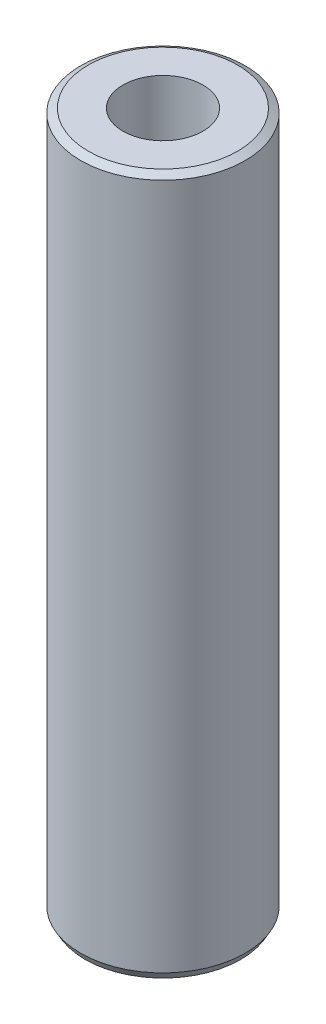
ISO-10303-21;
HEADER;
FILE_DESCRIPTION(('STEP AP214'),'2;1');
FILE_NAME('part.step','',(''),(''),'','','');
FILE_SCHEMA(('AUTOMOTIVE_DESIGN { 1 0 10303 214 1 1 1 1 }'));
ENDSEC;
DATA;
#1=APPLICATION_CONTEXT('core data for automotive mechanical design processes');
#2=APPLICATION_PROTOCOL_DEFINITION('international standard','automotive_design',2000,#1);
#3=PRODUCT_CONTEXT('',#1,'mechanical');
#4=PRODUCT('Part','Part','',(#3));
#5=PRODUCT_RELATED_PRODUCT_CATEGORY('part','',(#4));
#6=PRODUCT_DEFINITION_FORMATION('','',#4);
#7=PRODUCT_DEFINITION_CONTEXT('part definition',#1,'design');
#8=PRODUCT_DEFINITION('design','',#6,#7);
#9=PRODUCT_DEFINITION_SHAPE('','',#8);
#10=(LENGTH_UNIT() NAMED_UNIT(*) SI_UNIT(.MILLI.,.METRE.));
#11=(NAMED_UNIT(*) PLANE_ANGLE_UNIT() SI_UNIT($,.RADIAN.));
#12=(NAMED_UNIT(*) SI_UNIT($,.STERADIAN.) SOLID_ANGLE_UNIT());
#13=UNCERTAINTY_MEASURE_WITH_UNIT(LENGTH_MEASURE(1.E-05),#10,'distance_accuracy_value','');
#14=(GEOMETRIC_REPRESENTATION_CONTEXT(3) GLOBAL_UNCERTAINTY_ASSIGNED_CONTEXT((#13)) GLOBAL_UNIT_ASSIGNED_CONTEXT((#10,
#11,#12)) REPRESENTATION_CONTEXT('',''));
#15=CARTESIAN_POINT('',(0.,0.,0.));
#16=DIRECTION('',(0.,0.,1.));
#17=DIRECTION('',(1.,0.,0.));
#18=AXIS2_PLACEMENT_3D('',#15,#16,#17);
#19=CARTESIAN_POINT('',(0.,84.9295213359798,0.));
#20=DIRECTION('',(0.,-1.,0.));
#21=DIRECTION('',(0.,0.,-1.));
#22=AXIS2_PLACEMENT_3D('',#19,#20,#21);
#23=CYLINDRICAL_SURFACE('',#22,10.);
#24=CARTESIAN_POINT('',(0.,84.3989924388494,0.));
#25=DIRECTION('',(0.,1.,0.));
#26=DIRECTION('',(0.,0.,1.));
#27=AXIS2_PLACEMENT_3D('',#24,#25,#26);
#28=CIRCLE('',#27,10.);
#29=CARTESIAN_POINT('',(0.,84.3989924388494,10.));
#30=VERTEX_POINT('',#29);
#31=EDGE_CURVE('E50',#30,#30,#28,.F.);
#32=ORIENTED_EDGE('',*,*,#31,.T.);
#33=EDGE_LOOP('',(#32));
#34=FACE_BOUND('',#33,.T.);
#35=CARTESIAN_POINT('',(0.,0.918903004713367,0.));
#36=DIRECTION('',(0.,1.,0.));
#37=DIRECTION('',(0.,0.,1.));
#38=AXIS2_PLACEMENT_3D('',#35,#36,#37);
#39=CIRCLE('',#38,10.);
#40=CARTESIAN_POINT('',(0.,0.918903004713367,10.));
#41=VERTEX_POINT('',#40);
#42=EDGE_CURVE('E51',#41,#41,#39,.T.);
#43=ORIENTED_EDGE('',*,*,#42,.T.);
#44=EDGE_LOOP('',(#43));
#45=FACE_BOUND('',#44,.T.);
#46=ADVANCED_FACE('F39',(#34,#45),#23,.T.);
#47=CARTESIAN_POINT('',(0.,84.9295213359798,0.));
#48=DIRECTION('',(0.,1.,0.));
#49=DIRECTION('',(0.,0.,1.));
#50=AXIS2_PLACEMENT_3D('',#47,#48,#49);
#51=PLANE('',#50);
#52=CARTESIAN_POINT('',(0.,84.9295213359798,0.));
#53=DIRECTION('',(0.,1.,0.));
#54=DIRECTION('',(0.,0.,1.));
#55=AXIS2_PLACEMENT_3D('',#52,#53,#54);
#56=CIRCLE('',#55,9.0810969952866);
#57=CARTESIAN_POINT('',(0.,84.9295213359798,9.0810969952866));
#58=VERTEX_POINT('',#57);
#59=EDGE_CURVE('E54',#58,#58,#56,.T.);
#60=ORIENTED_EDGE('',*,*,#59,.T.);
#61=EDGE_LOOP('',(#60));
#62=FACE_BOUND('',#61,.T.);
#63=CARTESIAN_POINT('',(0.,84.9295213359798,0.));
#64=DIRECTION('',(0.,1.,0.));
#65=DIRECTION('',(0.,0.,1.));
#66=AXIS2_PLACEMENT_3D('',#63,#64,#65);
#67=CIRCLE('',#66,4.86979811108626);
#68=CARTESIAN_POINT('',(0.,84.9295213359798,4.86979811108626));
#69=VERTEX_POINT('',#68);
#70=EDGE_CURVE('E58',#69,#69,#67,.T.);
#71=ORIENTED_EDGE('',*,*,#70,.F.);
#72=EDGE_LOOP('',(#71));
#73=FACE_BOUND('',#72,.T.);
#74=ADVANCED_FACE('F69',(#62,#73),#51,.T.);
#75=CARTESIAN_POINT('',(0.,0.,0.));
#76=DIRECTION('',(0.,1.,0.));
#77=DIRECTION('',(0.,0.,1.));
#78=AXIS2_PLACEMENT_3D('',#75,#76,#77);
#79=PLANE('',#78);
#80=CARTESIAN_POINT('',(0.,0.,0.));
#81=DIRECTION('',(0.,1.,0.));
#82=DIRECTION('',(0.,0.,1.));
#83=AXIS2_PLACEMENT_3D('',#80,#81,#82);
#84=CIRCLE('',#83,9.46947110286958);
#85=CARTESIAN_POINT('',(0.,0.,9.46947110286958));
#86=VERTEX_POINT('',#85);
#87=EDGE_CURVE('E10',#86,#86,#84,.F.);
#88=ORIENTED_EDGE('',*,*,#87,.T.);
#89=EDGE_LOOP('',(#88));
#90=FACE_BOUND('',#89,.T.);
#91=CARTESIAN_POINT('',(0.,0.,0.));
#92=DIRECTION('',(0.,1.,0.));
#93=DIRECTION('',(0.,0.,1.));
#94=AXIS2_PLACEMENT_3D('',#91,#92,#93);
#95=CIRCLE('',#94,4.86979811108626);
#96=CARTESIAN_POINT('',(0.,0.,4.86979811108626));
#97=VERTEX_POINT('',#96);
#98=EDGE_CURVE('E63',#97,#97,#95,.T.);
#99=ORIENTED_EDGE('',*,*,#98,.T.);
#100=EDGE_LOOP('',(#99));
#101=FACE_BOUND('',#100,.T.);
#102=ADVANCED_FACE('F75',(#90,#101),#79,.F.);
#103=CARTESIAN_POINT('',(0.,84.9295213359798,0.));
#104=DIRECTION('',(0.,-1.,0.));
#105=DIRECTION('',(0.,0.,-1.));
#106=AXIS2_PLACEMENT_3D('',#103,#104,#105);
#107=CYLINDRICAL_SURFACE('',#106,4.86979811108626);
#108=ORIENTED_EDGE('',*,*,#70,.T.);
#109=EDGE_LOOP('',(#108));
#110=FACE_BOUND('',#109,.T.);
#111=ORIENTED_EDGE('',*,*,#98,.F.);
#112=EDGE_LOOP('',(#111));
#113=FACE_BOUND('',#112,.T.);
#114=ADVANCED_FACE('F70',(#110,#113),#107,.F.);
#115=CARTESIAN_POINT('',(0.,84.9295213359798,0.));
#116=DIRECTION('',(0.,-1.,0.));
#117=DIRECTION('',(0.,0.,-1.));
#118=AXIS2_PLACEMENT_3D('',#115,#116,#117);
#119=CONICAL_SURFACE('',#118,9.0810969952866,1.04719755119659);
#120=ORIENTED_EDGE('',*,*,#31,.F.);
#121=EDGE_LOOP('',(#120));
#122=FACE_BOUND('',#121,.T.);
#123=ORIENTED_EDGE('',*,*,#59,.F.);
#124=EDGE_LOOP('',(#123));
#125=FACE_BOUND('',#124,.T.);
#126=ADVANCED_FACE('F81',(#122,#125),#119,.T.);
#127=CARTESIAN_POINT('',(0.,0.918903004713367,0.));
#128=DIRECTION('',(0.,1.,0.));
#129=DIRECTION('',(0.,0.,1.));
#130=AXIS2_PLACEMENT_3D('',#127,#128,#129);
#131=CONICAL_SURFACE('',#130,10.,0.523598775598299);
#132=CARTESIAN_POINT('',(0.,0.,9.46947110286958));
#133=CARTESIAN_POINT('',(0.,0.00957190629909782,9.47499744554802));
#134=CARTESIAN_POINT('',(0.,0.0191438125981953,9.48052378822647));
#135=CARTESIAN_POINT('',(0.,0.0382876251963902,9.49157647358335));
#136=CARTESIAN_POINT('',(0.,0.0478595314954877,9.49710281626179));
#137=CARTESIAN_POINT('',(0.,0.0670033440936828,9.50815550161867));
#138=CARTESIAN_POINT('',(0.,0.0765752503927804,9.51368184429712));
#139=CARTESIAN_POINT('',(0.,0.0957190629909757,9.524734529654));
#140=CARTESIAN_POINT('',(0.,0.105290969290073,9.53026087233244));
#141=CARTESIAN_POINT('',(0.,0.124434781888268,9.54131355768932));
#142=CARTESIAN_POINT('',(0.,0.134006688187366,9.54683990036777));
#143=CARTESIAN_POINT('',(0.,0.153150500785561,9.55789258572465));
#144=CARTESIAN_POINT('',(0.,0.162722407084659,9.56341892840309));
#145=CARTESIAN_POINT('',(0.,0.181866219682854,9.57447161375998));
#146=CARTESIAN_POINT('',(0.,0.191438125981952,9.57999795643842));
#147=CARTESIAN_POINT('',(0.,0.210581938580147,9.5910506417953));
#148=CARTESIAN_POINT('',(0.,0.220153844879244,9.59657698447374));
#149=CARTESIAN_POINT('',(0.,0.239297657477439,9.60762966983063));
#150=CARTESIAN_POINT('',(0.,0.248869563776537,9.61315601250907));
#151=CARTESIAN_POINT('',(0.,0.268013376374732,9.62420869786595));
#152=CARTESIAN_POINT('',(0.,0.27758528267383,9.62973504054439));
#153=CARTESIAN_POINT('',(0.,0.296729095272025,9.64078772590128));
#154=CARTESIAN_POINT('',(0.,0.306301001571122,9.64631406857972));
#155=CARTESIAN_POINT('',(0.,0.325444814169317,9.65736675393661));
#156=CARTESIAN_POINT('',(0.,0.335016720468415,9.66289309661505));
#157=CARTESIAN_POINT('',(0.,0.35416053306661,9.67394578197193));
#158=CARTESIAN_POINT('',(0.,0.363732439365708,9.67947212465037));
#159=CARTESIAN_POINT('',(0.,0.382876251963903,9.69052481000725));
#160=CARTESIAN_POINT('',(0.,0.392448158263,9.6960511526857));
#161=CARTESIAN_POINT('',(0.,0.411591970861195,9.70710383804258));
#162=CARTESIAN_POINT('',(0.,0.421163877160293,9.71263018072102));
#163=CARTESIAN_POINT('',(0.,0.440307689758488,9.72368286607791));
#164=CARTESIAN_POINT('',(0.,0.449879596057586,9.72920920875635));
#165=CARTESIAN_POINT('',(0.,0.469023408655781,9.74026189411323));
#166=CARTESIAN_POINT('',(0.,0.478595314954879,9.74578823679168));
#167=CARTESIAN_POINT('',(0.,0.497739127553074,9.75684092214856));
#168=CARTESIAN_POINT('',(0.,0.507311033852171,9.762367264827));
#169=CARTESIAN_POINT('',(0.,0.526454846450367,9.77341995018388));
#170=CARTESIAN_POINT('',(0.,0.536026752749464,9.77894629286232));
#171=CARTESIAN_POINT('',(0.,0.555170565347659,9.78999897821921));
#172=CARTESIAN_POINT('',(0.,0.564742471646757,9.79552532089765));
#173=CARTESIAN_POINT('',(0.,0.583886284244952,9.80657800625453));
#174=CARTESIAN_POINT('',(0.,0.59345819054405,9.81210434893298));
#175=CARTESIAN_POINT('',(0.,0.612602003142245,9.82315703428986));
#176=CARTESIAN_POINT('',(0.,0.622173909441342,9.8286833769683));
#177=CARTESIAN_POINT('',(0.,0.641317722039537,9.83973606232519));
#178=CARTESIAN_POINT('',(0.,0.650889628338635,9.84526240500363));
#179=CARTESIAN_POINT('',(0.,0.67003344093683,9.85631509036051));
#180=CARTESIAN_POINT('',(0.,0.679605347235928,9.86184143303895));
#181=CARTESIAN_POINT('',(0.,0.698749159834123,9.87289411839584));
#182=CARTESIAN_POINT('',(0.,0.70832106613322,9.87842046107428));
#183=CARTESIAN_POINT('',(0.,0.727464878731416,9.88947314643116));
#184=CARTESIAN_POINT('',(0.,0.737036785030513,9.8949994891096));
#185=CARTESIAN_POINT('',(0.,0.756180597628708,9.90605217446649));
#186=CARTESIAN_POINT('',(0.,0.765752503927806,9.91157851714493));
#187=CARTESIAN_POINT('',(0.,0.784896316526001,9.92263120250181));
#188=CARTESIAN_POINT('',(0.,0.794468222825099,9.92815754518026));
#189=CARTESIAN_POINT('',(0.,0.813612035423294,9.93921023053714));
#190=CARTESIAN_POINT('',(0.,0.823183941722391,9.94473657321558));
#191=CARTESIAN_POINT('',(0.,0.842327754320587,9.95578925857247));
#192=CARTESIAN_POINT('',(0.,0.851899660619684,9.96131560125091));
#193=CARTESIAN_POINT('',(0.,0.871043473217879,9.97236828660779));
#194=CARTESIAN_POINT('',(0.,0.880615379516977,9.97789462928623));
#195=CARTESIAN_POINT('',(0.,0.899759192115172,9.98894731464312));
#196=CARTESIAN_POINT('',(0.,0.909331098414269,9.99447365732156));
#197=CARTESIAN_POINT('',(0.,0.918903004713367,10.));
#198=B_SPLINE_CURVE_WITH_KNOTS('',3,(#132,#133,#134,#135,#136,#137,#138,#139,#140,#141,#142,
#143,#144,#145,#146,#147,#148,#149,#150,#151,#152,#153,#154,#155,#156,#157,#158,#159,#160,#161,
#162,#163,#164,#165,#166,#167,#168,#169,#170,#171,#172,#173,#174,#175,#176,#177,#178,#179,#180,
#181,#182,#183,#184,#185,#186,#187,#188,#189,#190,#191,#192,#193,#194,#195,#196,#197),
.UNSPECIFIED.,.F.,.F.,(4,2,2,2,2,2,2,2,2,2,2,2,2,2,2,2,2,2,2,2,2,2,2,2,2,2,2,2,2,2,2,2,4),(0.,
0.0331580560706509,0.0663161121413026,0.0994741682119535,0.132632224282604,0.165790280353256,
0.198948336423907,0.232106392494558,0.26526444856521,0.29842250463586,0.331580560706511,
0.364738616777163,0.397896672847814,0.431054728918465,0.464212784989117,0.497370841059767,
0.530528897130418,0.56368695320107,0.596845009271721,0.630003065342372,0.663161121413024,
0.696319177483674,0.729477233554326,0.762635289624977,0.795793345695628,0.82895140176628,
0.86210945783693,0.895267513907581,0.928425569978233,0.961583626048884,0.994741682119535,
1.02789973819019,1.06105779426084),.UNSPECIFIED.);
#199=EDGE_CURVE('BSEAM45',#86,#41,#198,.T.);
#200=ORIENTED_EDGE('',*,*,#87,.F.);
#201=ORIENTED_EDGE('',*,*,#42,.F.);
#202=ORIENTED_EDGE('',*,*,#199,.T.);
#203=ORIENTED_EDGE('',*,*,#199,.F.);
#204=EDGE_LOOP('',(#200,#202,#201,#203));
#205=FACE_BOUND('',#204,.T.);
#206=ADVANCED_FACE('F45',(#205),#131,.T.);
#207=CLOSED_SHELL('',(#46,#74,#102,#114,#126,#206));
#208=MANIFOLD_SOLID_BREP('B2',#207);
#209=ADVANCED_BREP_SHAPE_REPRESENTATION('',(#18,#208),#14);
#210=SHAPE_DEFINITION_REPRESENTATION(#9,#209);
ENDSEC;
END-ISO-10303-21;
